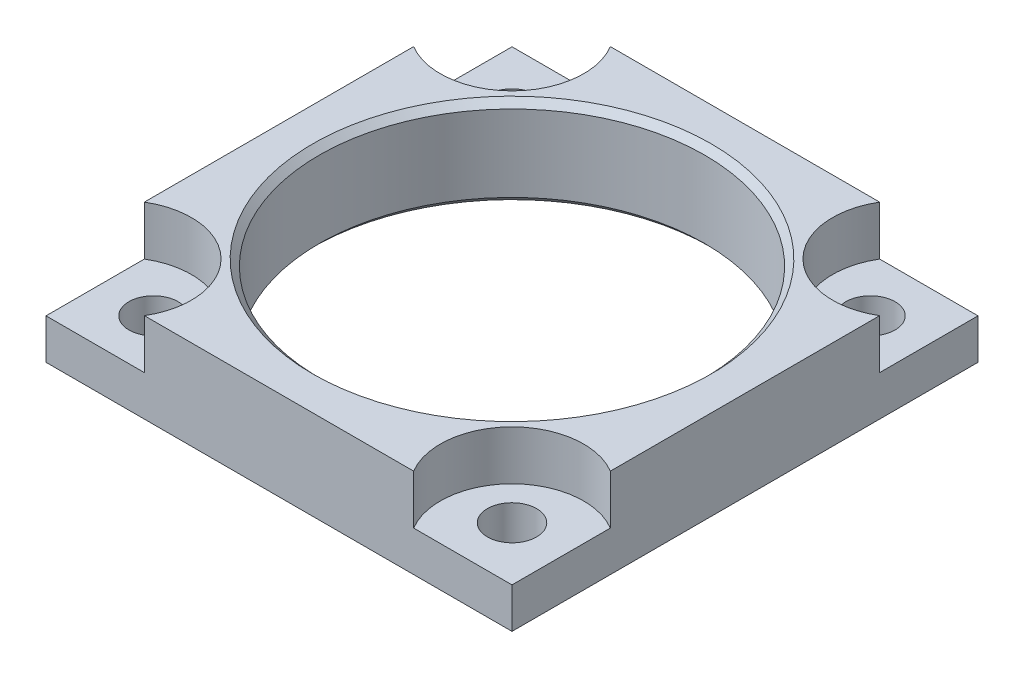
ISO-10303-21;
HEADER;
FILE_DESCRIPTION(('STEP AP214'),'2;1');
FILE_NAME('part.step','',(''),(''),'','','');
FILE_SCHEMA(('AUTOMOTIVE_DESIGN { 1 0 10303 214 1 1 1 1 }'));
ENDSEC;
DATA;
#1=APPLICATION_CONTEXT('core data for automotive mechanical design processes');
#2=APPLICATION_PROTOCOL_DEFINITION('international standard','automotive_design',2000,#1);
#3=PRODUCT_CONTEXT('',#1,'mechanical');
#4=PRODUCT('Part','Part','',(#3));
#5=PRODUCT_RELATED_PRODUCT_CATEGORY('part','',(#4));
#6=PRODUCT_DEFINITION_FORMATION('','',#4);
#7=PRODUCT_DEFINITION_CONTEXT('part definition',#1,'design');
#8=PRODUCT_DEFINITION('design','',#6,#7);
#9=PRODUCT_DEFINITION_SHAPE('','',#8);
#10=(LENGTH_UNIT() NAMED_UNIT(*) SI_UNIT(.MILLI.,.METRE.));
#11=(NAMED_UNIT(*) PLANE_ANGLE_UNIT() SI_UNIT($,.RADIAN.));
#12=(NAMED_UNIT(*) SI_UNIT($,.STERADIAN.) SOLID_ANGLE_UNIT());
#13=UNCERTAINTY_MEASURE_WITH_UNIT(LENGTH_MEASURE(1.E-05),#10,'distance_accuracy_value','');
#14=(GEOMETRIC_REPRESENTATION_CONTEXT(3) GLOBAL_UNCERTAINTY_ASSIGNED_CONTEXT((#13)) GLOBAL_UNIT_ASSIGNED_CONTEXT((#10,
#11,#12)) REPRESENTATION_CONTEXT('',''));
#15=CARTESIAN_POINT('',(0.,0.,0.));
#16=DIRECTION('',(0.,0.,1.));
#17=DIRECTION('',(1.,0.,0.));
#18=AXIS2_PLACEMENT_3D('',#15,#16,#17);
#19=CARTESIAN_POINT('',(0.,15.875,0.));
#20=DIRECTION('',(0.,-1.,0.));
#21=DIRECTION('',(0.,0.,-1.));
#22=AXIS2_PLACEMENT_3D('',#19,#20,#21);
#23=CYLINDRICAL_SURFACE('',#22,34.1503);
#24=CARTESIAN_POINT('',(0.,14.7193,0.));
#25=DIRECTION('',(0.,-1.,0.));
#26=DIRECTION('',(0.,0.,-1.));
#27=AXIS2_PLACEMENT_3D('',#24,#25,#26);
#28=CIRCLE('',#27,34.1503);
#29=CARTESIAN_POINT('',(0.,14.7193,-34.1503));
#30=VERTEX_POINT('',#29);
#31=EDGE_CURVE('E257',#30,#30,#28,.T.);
#32=ORIENTED_EDGE('',*,*,#31,.F.);
#33=EDGE_LOOP('',(#32));
#34=FACE_BOUND('',#33,.T.);
#35=CARTESIAN_POINT('',(0.,1.15570000000002,0.));
#36=DIRECTION('',(0.,-1.,0.));
#37=DIRECTION('',(0.,0.,-1.));
#38=AXIS2_PLACEMENT_3D('',#35,#36,#37);
#39=CIRCLE('',#38,34.1503);
#40=CARTESIAN_POINT('',(0.,1.15570000000002,-34.1503));
#41=VERTEX_POINT('',#40);
#42=EDGE_CURVE('E263',#41,#41,#39,.T.);
#43=ORIENTED_EDGE('',*,*,#42,.T.);
#44=EDGE_LOOP('',(#43));
#45=FACE_BOUND('',#44,.T.);
#46=ADVANCED_FACE('F33',(#34,#45),#23,.F.);
#47=CARTESIAN_POINT('',(-41.275,0.,41.275));
#48=DIRECTION('',(0.,1.,0.));
#49=DIRECTION('',(0.,0.,1.));
#50=AXIS2_PLACEMENT_3D('',#47,#48,#49);
#51=PLANE('',#50);
#52=DIRECTION('',(0.,0.,1.));
#53=VECTOR('',#52,1.);
#54=CARTESIAN_POINT('',(-41.275,0.,-41.275));
#55=LINE('',#54,#53);
#56=CARTESIAN_POINT('',(-41.275,0.,-41.275));
#57=VERTEX_POINT('',#56);
#58=CARTESIAN_POINT('',(-41.275,0.,41.275));
#59=VERTEX_POINT('',#58);
#60=EDGE_CURVE('E171',#57,#59,#55,.T.);
#61=ORIENTED_EDGE('',*,*,#60,.F.);
#62=DIRECTION('',(-1.,0.,0.));
#63=VECTOR('',#62,1.);
#64=CARTESIAN_POINT('',(-41.275,0.,-41.275));
#65=LINE('',#64,#63);
#66=CARTESIAN_POINT('',(41.275,0.,-41.275));
#67=VERTEX_POINT('',#66);
#68=EDGE_CURVE('E140',#67,#57,#65,.T.);
#69=ORIENTED_EDGE('',*,*,#68,.F.);
#70=DIRECTION('',(0.,0.,-1.));
#71=VECTOR('',#70,1.);
#72=CARTESIAN_POINT('',(41.275,0.,-41.275));
#73=LINE('',#72,#71);
#74=CARTESIAN_POINT('',(41.275,0.,41.275));
#75=VERTEX_POINT('',#74);
#76=EDGE_CURVE('E159',#75,#67,#73,.T.);
#77=ORIENTED_EDGE('',*,*,#76,.F.);
#78=DIRECTION('',(1.,0.,0.));
#79=VECTOR('',#78,1.);
#80=CARTESIAN_POINT('',(-41.275,0.,41.275));
#81=LINE('',#80,#79);
#82=EDGE_CURVE('E166',#59,#75,#81,.T.);
#83=ORIENTED_EDGE('',*,*,#82,.F.);
#84=EDGE_LOOP('',(#61,#69,#77,#83));
#85=FACE_BOUND('',#84,.T.);
#86=CARTESIAN_POINT('',(31.75,0.,-31.75));
#87=DIRECTION('',(0.,1.,0.));
#88=DIRECTION('',(0.,0.,1.));
#89=AXIS2_PLACEMENT_3D('',#86,#87,#88);
#90=CIRCLE('',#89,4.35610000000002);
#91=CARTESIAN_POINT('',(31.75,0.,-27.3939));
#92=VERTEX_POINT('',#91);
#93=EDGE_CURVE('E228',#92,#92,#90,.T.);
#94=ORIENTED_EDGE('',*,*,#93,.T.);
#95=EDGE_LOOP('',(#94));
#96=FACE_BOUND('',#95,.T.);
#97=CARTESIAN_POINT('',(31.75,0.,31.75));
#98=DIRECTION('',(0.,1.,0.));
#99=DIRECTION('',(0.,0.,1.));
#100=AXIS2_PLACEMENT_3D('',#97,#98,#99);
#101=CIRCLE('',#100,4.35610000000002);
#102=CARTESIAN_POINT('',(31.75,0.,36.1061));
#103=VERTEX_POINT('',#102);
#104=EDGE_CURVE('E236',#103,#103,#101,.T.);
#105=ORIENTED_EDGE('',*,*,#104,.T.);
#106=EDGE_LOOP('',(#105));
#107=FACE_BOUND('',#106,.T.);
#108=CARTESIAN_POINT('',(-31.75,0.,-31.75));
#109=DIRECTION('',(0.,1.,0.));
#110=DIRECTION('',(0.,0.,1.));
#111=AXIS2_PLACEMENT_3D('',#108,#109,#110);
#112=CIRCLE('',#111,4.35610000000001);
#113=CARTESIAN_POINT('',(-31.75,0.,-27.3939));
#114=VERTEX_POINT('',#113);
#115=EDGE_CURVE('E242',#114,#114,#112,.T.);
#116=ORIENTED_EDGE('',*,*,#115,.T.);
#117=EDGE_LOOP('',(#116));
#118=FACE_BOUND('',#117,.T.);
#119=CARTESIAN_POINT('',(-31.75,0.,31.75));
#120=DIRECTION('',(0.,1.,0.));
#121=DIRECTION('',(0.,0.,1.));
#122=AXIS2_PLACEMENT_3D('',#119,#120,#121);
#123=CIRCLE('',#122,4.35610000000001);
#124=CARTESIAN_POINT('',(-31.75,0.,36.1061));
#125=VERTEX_POINT('',#124);
#126=EDGE_CURVE('E248',#125,#125,#123,.T.);
#127=ORIENTED_EDGE('',*,*,#126,.T.);
#128=EDGE_LOOP('',(#127));
#129=FACE_BOUND('',#128,.T.);
#130=CARTESIAN_POINT('',(0.,0.,0.));
#131=DIRECTION('',(0.,-1.,0.));
#132=DIRECTION('',(0.,0.,-1.));
#133=AXIS2_PLACEMENT_3D('',#130,#131,#132);
#134=CIRCLE('',#133,35.306);
#135=CARTESIAN_POINT('',(0.,0.,-35.306));
#136=VERTEX_POINT('',#135);
#137=EDGE_CURVE('E260',#136,#136,#134,.T.);
#138=ORIENTED_EDGE('',*,*,#137,.F.);
#139=EDGE_LOOP('',(#138));
#140=FACE_BOUND('',#139,.T.);
#141=ADVANCED_FACE('F173',(#85,#96,#107,#118,#129,#140),#51,.F.);
#142=CARTESIAN_POINT('',(-41.275,15.875,41.275));
#143=DIRECTION('',(0.,1.,0.));
#144=DIRECTION('',(0.,0.,1.));
#145=AXIS2_PLACEMENT_3D('',#142,#143,#144);
#146=PLANE('',#145);
#147=CARTESIAN_POINT('',(-34.7472,15.875,-34.7472));
#148=DIRECTION('',(0.,1.,0.));
#149=DIRECTION('',(0.,0.,1.));
#150=AXIS2_PLACEMENT_3D('',#147,#148,#149);
#151=CIRCLE('',#150,12.7);
#152=CARTESIAN_POINT('',(-41.275,15.875,-23.8532646614733));
#153=VERTEX_POINT('',#152);
#154=CARTESIAN_POINT('',(-23.8532646614734,15.875,-41.275));
#155=VERTEX_POINT('',#154);
#156=EDGE_CURVE('E227',#153,#155,#151,.T.);
#157=ORIENTED_EDGE('',*,*,#156,.F.);
#158=DIRECTION('',(0.,0.,1.));
#159=VECTOR('',#158,1.);
#160=CARTESIAN_POINT('',(-41.275,15.875,-41.275));
#161=LINE('',#160,#159);
#162=CARTESIAN_POINT('',(-41.275,15.875,23.8532646614733));
#163=VERTEX_POINT('',#162);
#164=EDGE_CURVE('E175',#153,#163,#161,.T.);
#165=ORIENTED_EDGE('',*,*,#164,.T.);
#166=CARTESIAN_POINT('',(-34.7472,15.875,34.7472));
#167=DIRECTION('',(0.,1.,0.));
#168=DIRECTION('',(0.,0.,-1.));
#169=AXIS2_PLACEMENT_3D('',#166,#167,#168);
#170=CIRCLE('',#169,12.7);
#171=CARTESIAN_POINT('',(-23.8532646614733,15.875,41.275));
#172=VERTEX_POINT('',#171);
#173=EDGE_CURVE('E190',#172,#163,#170,.T.);
#174=ORIENTED_EDGE('',*,*,#173,.F.);
#175=DIRECTION('',(1.,0.,0.));
#176=VECTOR('',#175,1.);
#177=CARTESIAN_POINT('',(-41.275,15.875,41.275));
#178=LINE('',#177,#176);
#179=CARTESIAN_POINT('',(23.8532646614734,15.875,41.275));
#180=VERTEX_POINT('',#179);
#181=EDGE_CURVE('E181',#172,#180,#178,.T.);
#182=ORIENTED_EDGE('',*,*,#181,.T.);
#183=CARTESIAN_POINT('',(34.7472,15.875,34.7472));
#184=DIRECTION('',(0.,1.,0.));
#185=DIRECTION('',(0.,0.,1.));
#186=AXIS2_PLACEMENT_3D('',#183,#184,#185);
#187=CIRCLE('',#186,12.7);
#188=CARTESIAN_POINT('',(41.275,15.875,23.8532646614733));
#189=VERTEX_POINT('',#188);
#190=EDGE_CURVE('E206',#189,#180,#187,.T.);
#191=ORIENTED_EDGE('',*,*,#190,.F.);
#192=DIRECTION('',(0.,0.,-1.));
#193=VECTOR('',#192,1.);
#194=CARTESIAN_POINT('',(41.275,15.875,-41.275));
#195=LINE('',#194,#193);
#196=CARTESIAN_POINT('',(41.275,15.875,-23.8532646614733));
#197=VERTEX_POINT('',#196);
#198=EDGE_CURVE('E147',#189,#197,#195,.T.);
#199=ORIENTED_EDGE('',*,*,#198,.T.);
#200=CARTESIAN_POINT('',(34.7472,15.875,-34.7472));
#201=DIRECTION('',(0.,1.,0.));
#202=DIRECTION('',(0.,0.,-1.));
#203=AXIS2_PLACEMENT_3D('',#200,#201,#202);
#204=CIRCLE('',#203,12.7);
#205=CARTESIAN_POINT('',(23.8532646614734,15.875,-41.275));
#206=VERTEX_POINT('',#205);
#207=EDGE_CURVE('E218',#206,#197,#204,.T.);
#208=ORIENTED_EDGE('',*,*,#207,.F.);
#209=DIRECTION('',(-1.,0.,0.));
#210=VECTOR('',#209,1.);
#211=CARTESIAN_POINT('',(-41.275,15.875,-41.275));
#212=LINE('',#211,#210);
#213=EDGE_CURVE('E143',#206,#155,#212,.T.);
#214=ORIENTED_EDGE('',*,*,#213,.T.);
#215=EDGE_LOOP('',(#157,#165,#174,#182,#191,#199,#208,#214));
#216=FACE_BOUND('',#215,.T.);
#217=CARTESIAN_POINT('',(0.,15.875,0.));
#218=DIRECTION('',(0.,-1.,0.));
#219=DIRECTION('',(0.,0.,-1.));
#220=AXIS2_PLACEMENT_3D('',#217,#218,#219);
#221=CIRCLE('',#220,35.306);
#222=CARTESIAN_POINT('',(0.,15.875,-35.306));
#223=VERTEX_POINT('',#222);
#224=EDGE_CURVE('E254',#223,#223,#221,.T.);
#225=ORIENTED_EDGE('',*,*,#224,.T.);
#226=EDGE_LOOP('',(#225));
#227=FACE_BOUND('',#226,.T.);
#228=ADVANCED_FACE('F285',(#216,#227),#146,.T.);
#229=CARTESIAN_POINT('',(-34.7472,7.1374,34.7472));
#230=DIRECTION('',(0.,-1.,0.));
#231=DIRECTION('',(0.,0.,-1.));
#232=AXIS2_PLACEMENT_3D('',#229,#230,#231);
#233=PLANE('',#232);
#234=DIRECTION('',(1.,0.,0.));
#235=VECTOR('',#234,1.);
#236=CARTESIAN_POINT('',(-23.8532646614733,7.1374,41.275));
#237=LINE('',#236,#235);
#238=CARTESIAN_POINT('',(-41.275,7.1374,41.275));
#239=VERTEX_POINT('',#238);
#240=CARTESIAN_POINT('',(-23.8532646614733,7.1374,41.275));
#241=VERTEX_POINT('',#240);
#242=EDGE_CURVE('E193',#239,#241,#237,.T.);
#243=ORIENTED_EDGE('',*,*,#242,.T.);
#244=CARTESIAN_POINT('',(-34.7472,7.1374,34.7472));
#245=DIRECTION('',(0.,1.,0.));
#246=DIRECTION('',(0.,0.,-1.));
#247=AXIS2_PLACEMENT_3D('',#244,#245,#246);
#248=CIRCLE('',#247,12.7);
#249=CARTESIAN_POINT('',(-41.275,7.1374,23.8532646614733));
#250=VERTEX_POINT('',#249);
#251=EDGE_CURVE('E196',#241,#250,#248,.T.);
#252=ORIENTED_EDGE('',*,*,#251,.T.);
#253=DIRECTION('',(0.,0.,1.));
#254=VECTOR('',#253,1.);
#255=CARTESIAN_POINT('',(-41.275,7.1374,41.275));
#256=LINE('',#255,#254);
#257=EDGE_CURVE('E187',#250,#239,#256,.T.);
#258=ORIENTED_EDGE('',*,*,#257,.T.);
#259=EDGE_LOOP('',(#243,#252,#258));
#260=FACE_BOUND('',#259,.T.);
#261=CARTESIAN_POINT('',(-31.75,7.1374,31.75));
#262=DIRECTION('',(0.,1.,0.));
#263=DIRECTION('',(0.,0.,1.));
#264=AXIS2_PLACEMENT_3D('',#261,#262,#263);
#265=CIRCLE('',#264,4.35610000000002);
#266=CARTESIAN_POINT('',(-31.75,7.1374,36.1061));
#267=VERTEX_POINT('',#266);
#268=EDGE_CURVE('E251',#267,#267,#265,.T.);
#269=ORIENTED_EDGE('',*,*,#268,.F.);
#270=EDGE_LOOP('',(#269));
#271=FACE_BOUND('',#270,.T.);
#272=ADVANCED_FACE('F293',(#260,#271),#233,.F.);
#273=CARTESIAN_POINT('',(34.7472,7.1374,-34.7472));
#274=DIRECTION('',(0.,-1.,0.));
#275=DIRECTION('',(0.,0.,-1.));
#276=AXIS2_PLACEMENT_3D('',#273,#274,#275);
#277=PLANE('',#276);
#278=DIRECTION('',(-1.,0.,0.));
#279=VECTOR('',#278,1.);
#280=CARTESIAN_POINT('',(23.8532646614734,7.1374,-41.275));
#281=LINE('',#280,#279);
#282=CARTESIAN_POINT('',(41.275,7.1374,-41.275));
#283=VERTEX_POINT('',#282);
#284=CARTESIAN_POINT('',(23.8532646614734,7.1374,-41.275));
#285=VERTEX_POINT('',#284);
#286=EDGE_CURVE('E220',#283,#285,#281,.T.);
#287=ORIENTED_EDGE('',*,*,#286,.T.);
#288=CARTESIAN_POINT('',(34.7472,7.1374,-34.7472));
#289=DIRECTION('',(0.,1.,0.));
#290=DIRECTION('',(0.,0.,-1.));
#291=AXIS2_PLACEMENT_3D('',#288,#289,#290);
#292=CIRCLE('',#291,12.7);
#293=CARTESIAN_POINT('',(41.275,7.1374,-23.8532646614733));
#294=VERTEX_POINT('',#293);
#295=EDGE_CURVE('E222',#285,#294,#292,.T.);
#296=ORIENTED_EDGE('',*,*,#295,.T.);
#297=DIRECTION('',(0.,0.,-1.));
#298=VECTOR('',#297,1.);
#299=CARTESIAN_POINT('',(41.275,7.1374,-41.275));
#300=LINE('',#299,#298);
#301=EDGE_CURVE('E56',#294,#283,#300,.T.);
#302=ORIENTED_EDGE('',*,*,#301,.T.);
#303=EDGE_LOOP('',(#287,#296,#302));
#304=FACE_BOUND('',#303,.T.);
#305=CARTESIAN_POINT('',(31.75,7.1374,-31.75));
#306=DIRECTION('',(0.,1.,0.));
#307=DIRECTION('',(0.,0.,1.));
#308=AXIS2_PLACEMENT_3D('',#305,#306,#307);
#309=CIRCLE('',#308,4.35610000000002);
#310=CARTESIAN_POINT('',(31.75,7.1374,-27.3939));
#311=VERTEX_POINT('',#310);
#312=EDGE_CURVE('E233',#311,#311,#309,.T.);
#313=ORIENTED_EDGE('',*,*,#312,.F.);
#314=EDGE_LOOP('',(#313));
#315=FACE_BOUND('',#314,.T.);
#316=ADVANCED_FACE('F303',(#304,#315),#277,.F.);
#317=CARTESIAN_POINT('',(-41.275,15.875,-41.275));
#318=DIRECTION('',(1.,0.,0.));
#319=DIRECTION('',(0.,0.,-1.));
#320=AXIS2_PLACEMENT_3D('',#317,#318,#319);
#321=PLANE('',#320);
#322=ORIENTED_EDGE('',*,*,#164,.F.);
#323=DIRECTION('',(0.,1.,0.));
#324=VECTOR('',#323,1.);
#325=CARTESIAN_POINT('',(-41.275,7.1374,-23.8532646614733));
#326=LINE('',#325,#324);
#327=CARTESIAN_POINT('',(-41.275,7.1374,-23.8532646614733));
#328=VERTEX_POINT('',#327);
#329=EDGE_CURVE('E135',#328,#153,#326,.T.);
#330=ORIENTED_EDGE('',*,*,#329,.F.);
#331=DIRECTION('',(0.,0.,1.));
#332=VECTOR('',#331,1.);
#333=CARTESIAN_POINT('',(-41.275,7.1374,-41.275));
#334=LINE('',#333,#332);
#335=CARTESIAN_POINT('',(-41.275,7.1374,-41.275));
#336=VERTEX_POINT('',#335);
#337=EDGE_CURVE('E124',#336,#328,#334,.T.);
#338=ORIENTED_EDGE('',*,*,#337,.F.);
#339=DIRECTION('',(0.,-1.,0.));
#340=VECTOR('',#339,1.);
#341=CARTESIAN_POINT('',(-41.275,15.875,-41.275));
#342=LINE('',#341,#340);
#343=EDGE_CURVE('E133',#336,#57,#342,.T.);
#344=ORIENTED_EDGE('',*,*,#343,.T.);
#345=ORIENTED_EDGE('',*,*,#60,.T.);
#346=DIRECTION('',(0.,-1.,0.));
#347=VECTOR('',#346,1.);
#348=CARTESIAN_POINT('',(-41.275,15.875,41.275));
#349=LINE('',#348,#347);
#350=EDGE_CURVE('E11',#239,#59,#349,.T.);
#351=ORIENTED_EDGE('',*,*,#350,.F.);
#352=ORIENTED_EDGE('',*,*,#257,.F.);
#353=DIRECTION('',(0.,1.,0.));
#354=VECTOR('',#353,1.);
#355=CARTESIAN_POINT('',(-41.275,7.1374,23.8532646614733));
#356=LINE('',#355,#354);
#357=EDGE_CURVE('E177',#250,#163,#356,.T.);
#358=ORIENTED_EDGE('',*,*,#357,.T.);
#359=EDGE_LOOP('',(#322,#330,#338,#344,#345,#351,#352,#358));
#360=FACE_BOUND('',#359,.T.);
#361=ADVANCED_FACE('F35',(#360),#321,.F.);
#362=CARTESIAN_POINT('',(-41.275,15.875,41.275));
#363=DIRECTION('',(0.,0.,-1.));
#364=DIRECTION('',(-1.,0.,0.));
#365=AXIS2_PLACEMENT_3D('',#362,#363,#364);
#366=PLANE('',#365);
#367=DIRECTION('',(1.,0.,0.));
#368=VECTOR('',#367,1.);
#369=CARTESIAN_POINT('',(23.8532646614734,7.1374,41.275));
#370=LINE('',#369,#368);
#371=CARTESIAN_POINT('',(23.8532646614734,7.1374,41.275));
#372=VERTEX_POINT('',#371);
#373=CARTESIAN_POINT('',(41.275,7.1374,41.275));
#374=VERTEX_POINT('',#373);
#375=EDGE_CURVE('E203',#372,#374,#370,.T.);
#376=ORIENTED_EDGE('',*,*,#375,.F.);
#377=DIRECTION('',(0.,1.,0.));
#378=VECTOR('',#377,1.);
#379=CARTESIAN_POINT('',(23.8532646614734,7.1374,41.275));
#380=LINE('',#379,#378);
#381=EDGE_CURVE('E194',#372,#180,#380,.T.);
#382=ORIENTED_EDGE('',*,*,#381,.T.);
#383=ORIENTED_EDGE('',*,*,#181,.F.);
#384=DIRECTION('',(0.,1.,0.));
#385=VECTOR('',#384,1.);
#386=CARTESIAN_POINT('',(-23.8532646614733,7.1374,41.275));
#387=LINE('',#386,#385);
#388=EDGE_CURVE('E185',#241,#172,#387,.T.);
#389=ORIENTED_EDGE('',*,*,#388,.F.);
#390=ORIENTED_EDGE('',*,*,#242,.F.);
#391=ORIENTED_EDGE('',*,*,#350,.T.);
#392=ORIENTED_EDGE('',*,*,#82,.T.);
#393=DIRECTION('',(0.,-1.,0.));
#394=VECTOR('',#393,1.);
#395=CARTESIAN_POINT('',(41.275,15.875,41.275));
#396=LINE('',#395,#394);
#397=EDGE_CURVE('E41',#374,#75,#396,.T.);
#398=ORIENTED_EDGE('',*,*,#397,.F.);
#399=EDGE_LOOP('',(#376,#382,#383,#389,#390,#391,#392,#398));
#400=FACE_BOUND('',#399,.T.);
#401=ADVANCED_FACE('F167',(#400),#366,.F.);
#402=CARTESIAN_POINT('',(41.275,15.875,-41.275));
#403=DIRECTION('',(-1.,0.,0.));
#404=DIRECTION('',(0.,0.,1.));
#405=AXIS2_PLACEMENT_3D('',#402,#403,#404);
#406=PLANE('',#405);
#407=ORIENTED_EDGE('',*,*,#301,.F.);
#408=DIRECTION('',(0.,1.,0.));
#409=VECTOR('',#408,1.);
#410=CARTESIAN_POINT('',(41.275,7.1374,-23.8532646614733));
#411=LINE('',#410,#409);
#412=EDGE_CURVE('E208',#294,#197,#411,.T.);
#413=ORIENTED_EDGE('',*,*,#412,.T.);
#414=ORIENTED_EDGE('',*,*,#198,.F.);
#415=DIRECTION('',(0.,1.,0.));
#416=VECTOR('',#415,1.);
#417=CARTESIAN_POINT('',(41.275,7.1374,23.8532646614733));
#418=LINE('',#417,#416);
#419=CARTESIAN_POINT('',(41.275,7.1374,23.8532646614733));
#420=VERTEX_POINT('',#419);
#421=EDGE_CURVE('E201',#420,#189,#418,.T.);
#422=ORIENTED_EDGE('',*,*,#421,.F.);
#423=DIRECTION('',(0.,0.,-1.));
#424=VECTOR('',#423,1.);
#425=CARTESIAN_POINT('',(41.275,7.1374,41.275));
#426=LINE('',#425,#424);
#427=EDGE_CURVE('E162',#374,#420,#426,.T.);
#428=ORIENTED_EDGE('',*,*,#427,.F.);
#429=ORIENTED_EDGE('',*,*,#397,.T.);
#430=ORIENTED_EDGE('',*,*,#76,.T.);
#431=DIRECTION('',(0.,-1.,0.));
#432=VECTOR('',#431,1.);
#433=CARTESIAN_POINT('',(41.275,15.875,-41.275));
#434=LINE('',#433,#432);
#435=EDGE_CURVE('E142',#283,#67,#434,.T.);
#436=ORIENTED_EDGE('',*,*,#435,.F.);
#437=EDGE_LOOP('',(#407,#413,#414,#422,#428,#429,#430,#436));
#438=FACE_BOUND('',#437,.T.);
#439=ADVANCED_FACE('F156',(#438),#406,.F.);
#440=CARTESIAN_POINT('',(-41.275,15.875,-41.275));
#441=DIRECTION('',(0.,0.,1.));
#442=DIRECTION('',(1.,0.,0.));
#443=AXIS2_PLACEMENT_3D('',#440,#441,#442);
#444=PLANE('',#443);
#445=DIRECTION('',(-1.,0.,0.));
#446=VECTOR('',#445,1.);
#447=CARTESIAN_POINT('',(-23.8532646614734,7.1374,-41.275));
#448=LINE('',#447,#446);
#449=CARTESIAN_POINT('',(-23.8532646614733,7.1374,-41.275));
#450=VERTEX_POINT('',#449);
#451=EDGE_CURVE('E121',#450,#336,#448,.T.);
#452=ORIENTED_EDGE('',*,*,#451,.F.);
#453=DIRECTION('',(0.,1.,0.));
#454=VECTOR('',#453,1.);
#455=CARTESIAN_POINT('',(-23.8532646614734,7.1374,-41.275));
#456=LINE('',#455,#454);
#457=EDGE_CURVE('E136',#450,#155,#456,.T.);
#458=ORIENTED_EDGE('',*,*,#457,.T.);
#459=ORIENTED_EDGE('',*,*,#213,.F.);
#460=DIRECTION('',(0.,1.,0.));
#461=VECTOR('',#460,1.);
#462=CARTESIAN_POINT('',(23.8532646614734,7.1374,-41.275));
#463=LINE('',#462,#461);
#464=EDGE_CURVE('E214',#285,#206,#463,.T.);
#465=ORIENTED_EDGE('',*,*,#464,.F.);
#466=ORIENTED_EDGE('',*,*,#286,.F.);
#467=ORIENTED_EDGE('',*,*,#435,.T.);
#468=ORIENTED_EDGE('',*,*,#68,.T.);
#469=ORIENTED_EDGE('',*,*,#343,.F.);
#470=EDGE_LOOP('',(#452,#458,#459,#465,#466,#467,#468,#469));
#471=FACE_BOUND('',#470,.T.);
#472=ADVANCED_FACE('F138',(#471),#444,.F.);
#473=CARTESIAN_POINT('',(-34.7472,7.1374,34.7472));
#474=DIRECTION('',(0.,1.,0.));
#475=DIRECTION('',(0.,0.,1.));
#476=AXIS2_PLACEMENT_3D('',#473,#474,#475);
#477=CYLINDRICAL_SURFACE('',#476,12.7);
#478=ORIENTED_EDGE('',*,*,#173,.T.);
#479=ORIENTED_EDGE('',*,*,#357,.F.);
#480=ORIENTED_EDGE('',*,*,#251,.F.);
#481=ORIENTED_EDGE('',*,*,#388,.T.);
#482=EDGE_LOOP('',(#478,#479,#480,#481));
#483=FACE_BOUND('',#482,.T.);
#484=ADVANCED_FACE('F290',(#483),#477,.F.);
#485=CARTESIAN_POINT('',(34.7472,7.1374,34.7472));
#486=DIRECTION('',(0.,1.,0.));
#487=DIRECTION('',(0.,0.,1.));
#488=AXIS2_PLACEMENT_3D('',#485,#486,#487);
#489=CYLINDRICAL_SURFACE('',#488,12.7);
#490=ORIENTED_EDGE('',*,*,#190,.T.);
#491=ORIENTED_EDGE('',*,*,#381,.F.);
#492=CARTESIAN_POINT('',(34.7472,7.1374,34.7472));
#493=DIRECTION('',(0.,1.,0.));
#494=DIRECTION('',(0.,0.,1.));
#495=AXIS2_PLACEMENT_3D('',#492,#493,#494);
#496=CIRCLE('',#495,12.7);
#497=EDGE_CURVE('E210',#420,#372,#496,.T.);
#498=ORIENTED_EDGE('',*,*,#497,.F.);
#499=ORIENTED_EDGE('',*,*,#421,.T.);
#500=EDGE_LOOP('',(#490,#491,#498,#499));
#501=FACE_BOUND('',#500,.T.);
#502=ADVANCED_FACE('F324',(#501),#489,.F.);
#503=CARTESIAN_POINT('',(34.7472,7.1374,34.7472));
#504=DIRECTION('',(0.,1.,0.));
#505=DIRECTION('',(0.,0.,1.));
#506=AXIS2_PLACEMENT_3D('',#503,#504,#505);
#507=PLANE('',#506);
#508=CARTESIAN_POINT('',(31.75,7.1374,31.75));
#509=DIRECTION('',(0.,1.,0.));
#510=DIRECTION('',(0.,0.,1.));
#511=AXIS2_PLACEMENT_3D('',#508,#509,#510);
#512=CIRCLE('',#511,4.35610000000002);
#513=CARTESIAN_POINT('',(31.75,7.1374,36.1061));
#514=VERTEX_POINT('',#513);
#515=EDGE_CURVE('E239',#514,#514,#512,.T.);
#516=ORIENTED_EDGE('',*,*,#515,.F.);
#517=EDGE_LOOP('',(#516));
#518=FACE_BOUND('',#517,.T.);
#519=ORIENTED_EDGE('',*,*,#427,.T.);
#520=ORIENTED_EDGE('',*,*,#497,.T.);
#521=ORIENTED_EDGE('',*,*,#375,.T.);
#522=EDGE_LOOP('',(#519,#520,#521));
#523=FACE_BOUND('',#522,.T.);
#524=ADVANCED_FACE('F320',(#518,#523),#507,.T.);
#525=CARTESIAN_POINT('',(34.7472,7.1374,-34.7472));
#526=DIRECTION('',(0.,1.,0.));
#527=DIRECTION('',(0.,0.,1.));
#528=AXIS2_PLACEMENT_3D('',#525,#526,#527);
#529=CYLINDRICAL_SURFACE('',#528,12.7);
#530=ORIENTED_EDGE('',*,*,#207,.T.);
#531=ORIENTED_EDGE('',*,*,#412,.F.);
#532=ORIENTED_EDGE('',*,*,#295,.F.);
#533=ORIENTED_EDGE('',*,*,#464,.T.);
#534=EDGE_LOOP('',(#530,#531,#532,#533));
#535=FACE_BOUND('',#534,.T.);
#536=ADVANCED_FACE('F317',(#535),#529,.F.);
#537=CARTESIAN_POINT('',(-34.7472,7.1374,-34.7472));
#538=DIRECTION('',(0.,1.,0.));
#539=DIRECTION('',(0.,0.,1.));
#540=AXIS2_PLACEMENT_3D('',#537,#538,#539);
#541=CYLINDRICAL_SURFACE('',#540,12.7);
#542=ORIENTED_EDGE('',*,*,#156,.T.);
#543=ORIENTED_EDGE('',*,*,#457,.F.);
#544=CARTESIAN_POINT('',(-34.7472,7.1374,-34.7472));
#545=DIRECTION('',(0.,1.,0.));
#546=DIRECTION('',(0.,0.,1.));
#547=AXIS2_PLACEMENT_3D('',#544,#545,#546);
#548=CIRCLE('',#547,12.7);
#549=EDGE_CURVE('E48',#328,#450,#548,.T.);
#550=ORIENTED_EDGE('',*,*,#549,.F.);
#551=ORIENTED_EDGE('',*,*,#329,.T.);
#552=EDGE_LOOP('',(#542,#543,#550,#551));
#553=FACE_BOUND('',#552,.T.);
#554=ADVANCED_FACE('F315',(#553),#541,.F.);
#555=CARTESIAN_POINT('',(-34.7472,7.1374,-34.7472));
#556=DIRECTION('',(0.,1.,0.));
#557=DIRECTION('',(0.,0.,1.));
#558=AXIS2_PLACEMENT_3D('',#555,#556,#557);
#559=PLANE('',#558);
#560=CARTESIAN_POINT('',(-31.75,7.1374,-31.75));
#561=DIRECTION('',(0.,1.,0.));
#562=DIRECTION('',(0.,0.,1.));
#563=AXIS2_PLACEMENT_3D('',#560,#561,#562);
#564=CIRCLE('',#563,4.35610000000002);
#565=CARTESIAN_POINT('',(-31.75,7.1374,-27.3939));
#566=VERTEX_POINT('',#565);
#567=EDGE_CURVE('E245',#566,#566,#564,.T.);
#568=ORIENTED_EDGE('',*,*,#567,.F.);
#569=EDGE_LOOP('',(#568));
#570=FACE_BOUND('',#569,.T.);
#571=ORIENTED_EDGE('',*,*,#549,.T.);
#572=ORIENTED_EDGE('',*,*,#451,.T.);
#573=ORIENTED_EDGE('',*,*,#337,.T.);
#574=EDGE_LOOP('',(#571,#572,#573));
#575=FACE_BOUND('',#574,.T.);
#576=ADVANCED_FACE('F123',(#570,#575),#559,.T.);
#577=CARTESIAN_POINT('',(31.75,7.1374,-31.75));
#578=DIRECTION('',(0.,1.,0.));
#579=DIRECTION('',(0.,0.,1.));
#580=AXIS2_PLACEMENT_3D('',#577,#578,#579);
#581=CYLINDRICAL_SURFACE('',#580,4.35610000000002);
#582=ORIENTED_EDGE('',*,*,#93,.F.);
#583=EDGE_LOOP('',(#582));
#584=FACE_BOUND('',#583,.T.);
#585=ORIENTED_EDGE('',*,*,#312,.T.);
#586=EDGE_LOOP('',(#585));
#587=FACE_BOUND('',#586,.T.);
#588=ADVANCED_FACE('F357',(#584,#587),#581,.F.);
#589=CARTESIAN_POINT('',(31.75,7.1374,31.75));
#590=DIRECTION('',(0.,1.,0.));
#591=DIRECTION('',(0.,0.,1.));
#592=AXIS2_PLACEMENT_3D('',#589,#590,#591);
#593=CYLINDRICAL_SURFACE('',#592,4.35610000000002);
#594=ORIENTED_EDGE('',*,*,#104,.F.);
#595=EDGE_LOOP('',(#594));
#596=FACE_BOUND('',#595,.T.);
#597=ORIENTED_EDGE('',*,*,#515,.T.);
#598=EDGE_LOOP('',(#597));
#599=FACE_BOUND('',#598,.T.);
#600=ADVANCED_FACE('F350',(#596,#599),#593,.F.);
#601=CARTESIAN_POINT('',(-31.75,7.1374,-31.75));
#602=DIRECTION('',(0.,1.,0.));
#603=DIRECTION('',(0.,0.,1.));
#604=AXIS2_PLACEMENT_3D('',#601,#602,#603);
#605=CYLINDRICAL_SURFACE('',#604,4.35610000000001);
#606=ORIENTED_EDGE('',*,*,#115,.F.);
#607=EDGE_LOOP('',(#606));
#608=FACE_BOUND('',#607,.T.);
#609=ORIENTED_EDGE('',*,*,#567,.T.);
#610=EDGE_LOOP('',(#609));
#611=FACE_BOUND('',#610,.T.);
#612=ADVANCED_FACE('F344',(#608,#611),#605,.F.);
#613=CARTESIAN_POINT('',(-31.75,7.1374,31.75));
#614=DIRECTION('',(0.,1.,0.));
#615=DIRECTION('',(0.,0.,1.));
#616=AXIS2_PLACEMENT_3D('',#613,#614,#615);
#617=CYLINDRICAL_SURFACE('',#616,4.35610000000001);
#618=ORIENTED_EDGE('',*,*,#126,.F.);
#619=EDGE_LOOP('',(#618));
#620=FACE_BOUND('',#619,.T.);
#621=ORIENTED_EDGE('',*,*,#268,.T.);
#622=EDGE_LOOP('',(#621));
#623=FACE_BOUND('',#622,.T.);
#624=ADVANCED_FACE('F276',(#620,#623),#617,.F.);
#625=CARTESIAN_POINT('',(0.,15.875,0.));
#626=DIRECTION('',(0.,1.,0.));
#627=DIRECTION('',(0.,0.,1.));
#628=AXIS2_PLACEMENT_3D('',#625,#626,#627);
#629=CONICAL_SURFACE('',#628,35.306,0.785398163397442);
#630=ORIENTED_EDGE('',*,*,#31,.T.);
#631=EDGE_LOOP('',(#630));
#632=FACE_BOUND('',#631,.T.);
#633=ORIENTED_EDGE('',*,*,#224,.F.);
#634=EDGE_LOOP('',(#633));
#635=FACE_BOUND('',#634,.T.);
#636=ADVANCED_FACE('F270',(#632,#635),#629,.F.);
#637=CARTESIAN_POINT('',(0.,1.15570000000002,0.));
#638=DIRECTION('',(0.,-1.,0.));
#639=DIRECTION('',(0.,0.,-1.));
#640=AXIS2_PLACEMENT_3D('',#637,#638,#639);
#641=CONICAL_SURFACE('',#640,34.1503,0.785398163397441);
#642=ORIENTED_EDGE('',*,*,#137,.T.);
#643=EDGE_LOOP('',(#642));
#644=FACE_BOUND('',#643,.T.);
#645=ORIENTED_EDGE('',*,*,#42,.F.);
#646=EDGE_LOOP('',(#645));
#647=FACE_BOUND('',#646,.T.);
#648=ADVANCED_FACE('F268',(#644,#647),#641,.F.);
#649=CLOSED_SHELL('',(#46,#141,#228,#272,#316,#361,#401,#439,#472,#484,#502,#524,#536,#554,#576,
#588,#600,#612,#624,#636,#648));
#650=MANIFOLD_SOLID_BREP('B2',#649);
#651=ADVANCED_BREP_SHAPE_REPRESENTATION('',(#18,#650),#14);
#652=SHAPE_DEFINITION_REPRESENTATION(#9,#651);
ENDSEC;
END-ISO-10303-21;
